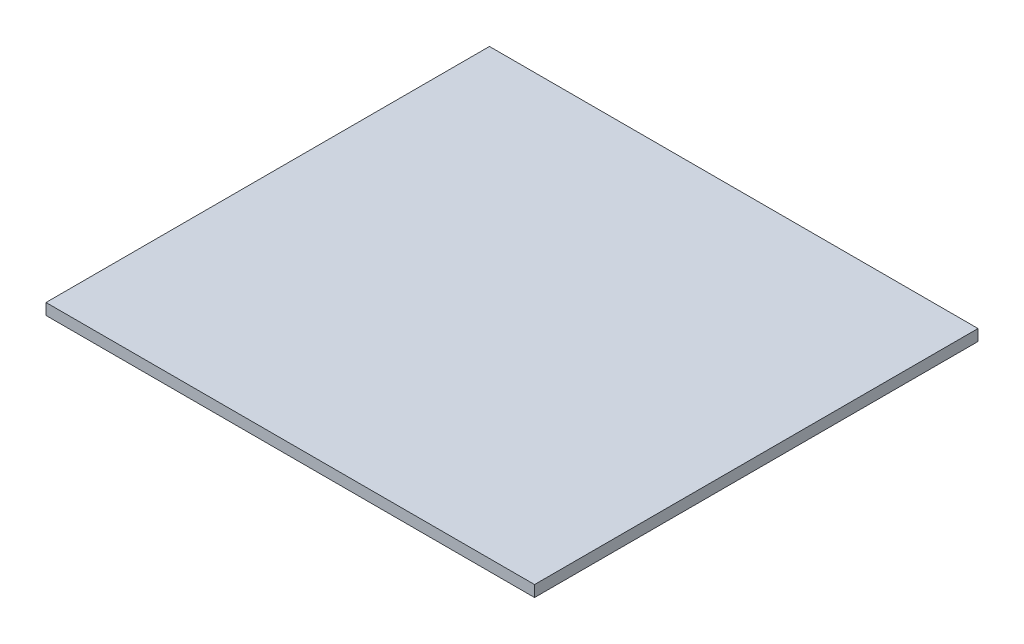
ISO-10303-21;
HEADER;
FILE_DESCRIPTION(('STEP AP214'),'2;1');
FILE_NAME('part.step','',(''),(''),'','','');
FILE_SCHEMA(('AUTOMOTIVE_DESIGN { 1 0 10303 214 1 1 1 1 }'));
ENDSEC;
DATA;
#1=APPLICATION_CONTEXT('core data for automotive mechanical design processes');
#2=APPLICATION_PROTOCOL_DEFINITION('international standard','automotive_design',2000,#1);
#3=PRODUCT_CONTEXT('',#1,'mechanical');
#4=PRODUCT('Part','Part','',(#3));
#5=PRODUCT_RELATED_PRODUCT_CATEGORY('part','',(#4));
#6=PRODUCT_DEFINITION_FORMATION('','',#4);
#7=PRODUCT_DEFINITION_CONTEXT('part definition',#1,'design');
#8=PRODUCT_DEFINITION('design','',#6,#7);
#9=PRODUCT_DEFINITION_SHAPE('','',#8);
#10=(LENGTH_UNIT() NAMED_UNIT(*) SI_UNIT(.MILLI.,.METRE.));
#11=(NAMED_UNIT(*) PLANE_ANGLE_UNIT() SI_UNIT($,.RADIAN.));
#12=(NAMED_UNIT(*) SI_UNIT($,.STERADIAN.) SOLID_ANGLE_UNIT());
#13=UNCERTAINTY_MEASURE_WITH_UNIT(LENGTH_MEASURE(1.E-05),#10,'distance_accuracy_value','');
#14=(GEOMETRIC_REPRESENTATION_CONTEXT(3) GLOBAL_UNCERTAINTY_ASSIGNED_CONTEXT((#13)) GLOBAL_UNIT_ASSIGNED_CONTEXT((#10,
#11,#12)) REPRESENTATION_CONTEXT('',''));
#15=CARTESIAN_POINT('',(0.,0.,0.));
#16=DIRECTION('',(0.,0.,1.));
#17=DIRECTION('',(1.,0.,0.));
#18=AXIS2_PLACEMENT_3D('',#15,#16,#17);
#19=CARTESIAN_POINT('',(-106.132795847539,3.,-64.853856836145));
#20=DIRECTION('',(1.,0.,0.));
#21=DIRECTION('',(0.,0.,-1.));
#22=AXIS2_PLACEMENT_3D('',#19,#20,#21);
#23=PLANE('',#22);
#24=DIRECTION('',(0.,0.,1.));
#25=VECTOR('',#24,1.);
#26=CARTESIAN_POINT('',(-106.132795847539,0.,-64.853856836145));
#27=LINE('',#26,#25);
#28=CARTESIAN_POINT('',(-106.132795847539,0.,-64.853856836145));
#29=VERTEX_POINT('',#28);
#30=CARTESIAN_POINT('',(-106.132795847539,0.,53.146143163855));
#31=VERTEX_POINT('',#30);
#32=EDGE_CURVE('E96',#29,#31,#27,.T.);
#33=ORIENTED_EDGE('',*,*,#32,.T.);
#34=DIRECTION('',(0.,-1.,0.));
#35=VECTOR('',#34,1.);
#36=CARTESIAN_POINT('',(-106.132795847539,3.,53.146143163855));
#37=LINE('',#36,#35);
#38=CARTESIAN_POINT('',(-106.132795847539,3.,53.146143163855));
#39=VERTEX_POINT('',#38);
#40=EDGE_CURVE('E11',#39,#31,#37,.T.);
#41=ORIENTED_EDGE('',*,*,#40,.F.);
#42=DIRECTION('',(0.,0.,1.));
#43=VECTOR('',#42,1.);
#44=CARTESIAN_POINT('',(-106.132795847539,3.,-64.853856836145));
#45=LINE('',#44,#43);
#46=CARTESIAN_POINT('',(-106.132795847539,3.,-64.853856836145));
#47=VERTEX_POINT('',#46);
#48=EDGE_CURVE('E84',#47,#39,#45,.T.);
#49=ORIENTED_EDGE('',*,*,#48,.F.);
#50=DIRECTION('',(0.,-1.,0.));
#51=VECTOR('',#50,1.);
#52=CARTESIAN_POINT('',(-106.132795847539,3.,-64.853856836145));
#53=LINE('',#52,#51);
#54=EDGE_CURVE('E92',#47,#29,#53,.T.);
#55=ORIENTED_EDGE('',*,*,#54,.T.);
#56=EDGE_LOOP('',(#33,#41,#49,#55));
#57=FACE_BOUND('',#56,.T.);
#58=ADVANCED_FACE('F33',(#57),#23,.F.);
#59=CARTESIAN_POINT('',(-106.132795847539,3.,53.146143163855));
#60=DIRECTION('',(0.,0.,-1.));
#61=DIRECTION('',(-1.,0.,0.));
#62=AXIS2_PLACEMENT_3D('',#59,#60,#61);
#63=PLANE('',#62);
#64=DIRECTION('',(1.,0.,0.));
#65=VECTOR('',#64,1.);
#66=CARTESIAN_POINT('',(-106.132795847539,0.,53.146143163855));
#67=LINE('',#66,#65);
#68=CARTESIAN_POINT('',(23.8672041524607,0.,53.146143163855));
#69=VERTEX_POINT('',#68);
#70=EDGE_CURVE('E88',#31,#69,#67,.T.);
#71=ORIENTED_EDGE('',*,*,#70,.T.);
#72=DIRECTION('',(0.,-1.,0.));
#73=VECTOR('',#72,1.);
#74=CARTESIAN_POINT('',(23.8672041524607,3.,53.146143163855));
#75=LINE('',#74,#73);
#76=CARTESIAN_POINT('',(23.8672041524607,3.,53.146143163855));
#77=VERTEX_POINT('',#76);
#78=EDGE_CURVE('E41',#77,#69,#75,.T.);
#79=ORIENTED_EDGE('',*,*,#78,.F.);
#80=DIRECTION('',(1.,0.,0.));
#81=VECTOR('',#80,1.);
#82=CARTESIAN_POINT('',(-106.132795847539,3.,53.146143163855));
#83=LINE('',#82,#81);
#84=EDGE_CURVE('E79',#39,#77,#83,.T.);
#85=ORIENTED_EDGE('',*,*,#84,.F.);
#86=ORIENTED_EDGE('',*,*,#40,.T.);
#87=EDGE_LOOP('',(#71,#79,#85,#86));
#88=FACE_BOUND('',#87,.T.);
#89=ADVANCED_FACE('F87',(#88),#63,.F.);
#90=CARTESIAN_POINT('',(23.8672041524606,3.,-64.853856836145));
#91=DIRECTION('',(-1.,0.,0.));
#92=DIRECTION('',(0.,0.,1.));
#93=AXIS2_PLACEMENT_3D('',#90,#91,#92);
#94=PLANE('',#93);
#95=DIRECTION('',(0.,0.,-1.));
#96=VECTOR('',#95,1.);
#97=CARTESIAN_POINT('',(23.8672041524606,0.,-64.853856836145));
#98=LINE('',#97,#96);
#99=CARTESIAN_POINT('',(23.8672041524606,0.,-64.853856836145));
#100=VERTEX_POINT('',#99);
#101=EDGE_CURVE('E66',#69,#100,#98,.T.);
#102=ORIENTED_EDGE('',*,*,#101,.T.);
#103=DIRECTION('',(0.,-1.,0.));
#104=VECTOR('',#103,1.);
#105=CARTESIAN_POINT('',(23.8672041524606,3.,-64.853856836145));
#106=LINE('',#105,#104);
#107=CARTESIAN_POINT('',(23.8672041524606,3.,-64.853856836145));
#108=VERTEX_POINT('',#107);
#109=EDGE_CURVE('E89',#108,#100,#106,.T.);
#110=ORIENTED_EDGE('',*,*,#109,.F.);
#111=DIRECTION('',(0.,0.,-1.));
#112=VECTOR('',#111,1.);
#113=CARTESIAN_POINT('',(23.8672041524606,3.,-64.853856836145));
#114=LINE('',#113,#112);
#115=EDGE_CURVE('E82',#77,#108,#114,.T.);
#116=ORIENTED_EDGE('',*,*,#115,.F.);
#117=ORIENTED_EDGE('',*,*,#78,.T.);
#118=EDGE_LOOP('',(#102,#110,#116,#117));
#119=FACE_BOUND('',#118,.T.);
#120=ADVANCED_FACE('F90',(#119),#94,.F.);
#121=CARTESIAN_POINT('',(-106.132795847539,3.,-64.853856836145));
#122=DIRECTION('',(0.,0.,1.));
#123=DIRECTION('',(1.,0.,0.));
#124=AXIS2_PLACEMENT_3D('',#121,#122,#123);
#125=PLANE('',#124);
#126=DIRECTION('',(-1.,0.,0.));
#127=VECTOR('',#126,1.);
#128=CARTESIAN_POINT('',(-106.132795847539,0.,-64.853856836145));
#129=LINE('',#128,#127);
#130=EDGE_CURVE('E72',#100,#29,#129,.T.);
#131=ORIENTED_EDGE('',*,*,#130,.T.);
#132=ORIENTED_EDGE('',*,*,#54,.F.);
#133=DIRECTION('',(-1.,0.,0.));
#134=VECTOR('',#133,1.);
#135=CARTESIAN_POINT('',(-106.132795847539,3.,-64.853856836145));
#136=LINE('',#135,#134);
#137=EDGE_CURVE('E49',#108,#47,#136,.T.);
#138=ORIENTED_EDGE('',*,*,#137,.F.);
#139=ORIENTED_EDGE('',*,*,#109,.T.);
#140=EDGE_LOOP('',(#131,#132,#138,#139));
#141=FACE_BOUND('',#140,.T.);
#142=ADVANCED_FACE('F103',(#141),#125,.F.);
#143=CARTESIAN_POINT('',(0.,3.,0.));
#144=DIRECTION('',(0.,1.,0.));
#145=DIRECTION('',(0.,0.,1.));
#146=AXIS2_PLACEMENT_3D('',#143,#144,#145);
#147=PLANE('',#146);
#148=ORIENTED_EDGE('',*,*,#48,.T.);
#149=ORIENTED_EDGE('',*,*,#84,.T.);
#150=ORIENTED_EDGE('',*,*,#115,.T.);
#151=ORIENTED_EDGE('',*,*,#137,.T.);
#152=EDGE_LOOP('',(#148,#149,#150,#151));
#153=FACE_BOUND('',#152,.T.);
#154=ADVANCED_FACE('F80',(#153),#147,.T.);
#155=CARTESIAN_POINT('',(0.,0.,0.));
#156=DIRECTION('',(0.,1.,0.));
#157=DIRECTION('',(0.,0.,1.));
#158=AXIS2_PLACEMENT_3D('',#155,#156,#157);
#159=PLANE('',#158);
#160=ORIENTED_EDGE('',*,*,#32,.F.);
#161=ORIENTED_EDGE('',*,*,#130,.F.);
#162=ORIENTED_EDGE('',*,*,#101,.F.);
#163=ORIENTED_EDGE('',*,*,#70,.F.);
#164=EDGE_LOOP('',(#160,#161,#162,#163));
#165=FACE_BOUND('',#164,.T.);
#166=ADVANCED_FACE('F106',(#165),#159,.F.);
#167=CLOSED_SHELL('',(#58,#89,#120,#142,#154,#166));
#168=MANIFOLD_SOLID_BREP('B2',#167);
#169=ADVANCED_BREP_SHAPE_REPRESENTATION('',(#18,#168),#14);
#170=SHAPE_DEFINITION_REPRESENTATION(#9,#169);
ENDSEC;
END-ISO-10303-21;
